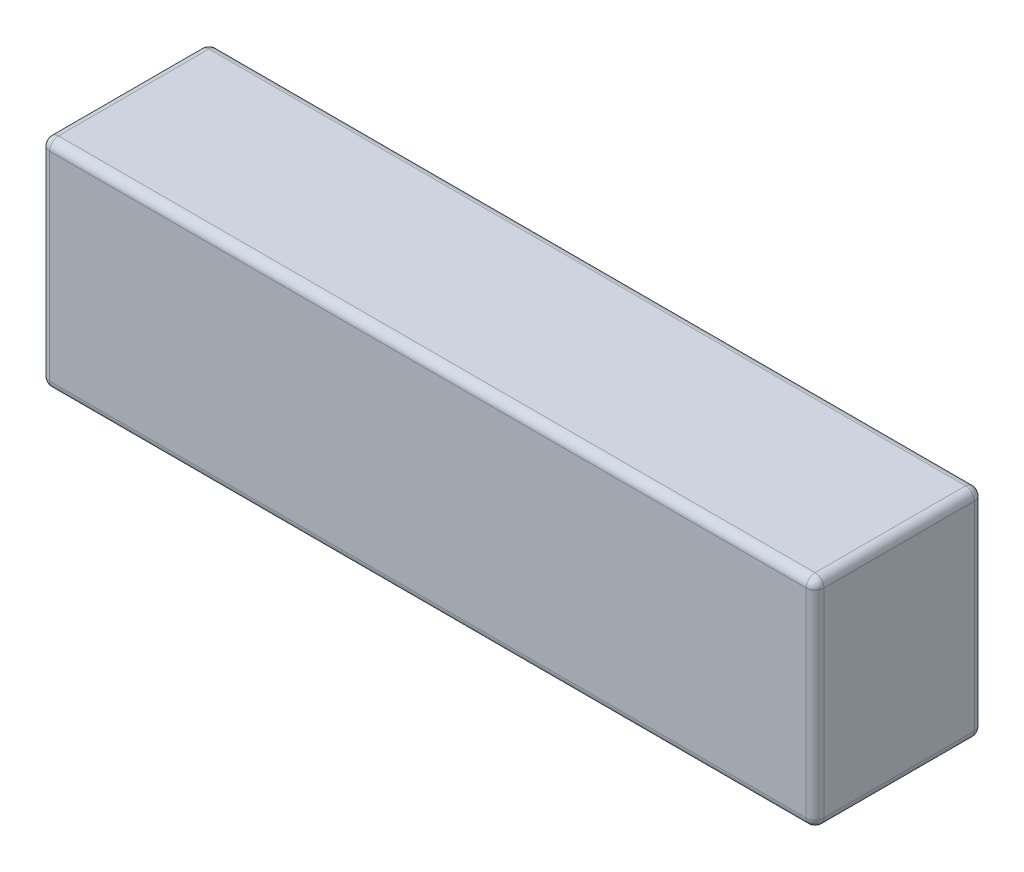
ISO-10303-21;
HEADER;
FILE_DESCRIPTION(('STEP AP214'),'2;1');
FILE_NAME('part.step','',(''),(''),'','','');
FILE_SCHEMA(('AUTOMOTIVE_DESIGN { 1 0 10303 214 1 1 1 1 }'));
ENDSEC;
DATA;
#1=APPLICATION_CONTEXT('core data for automotive mechanical design processes');
#2=APPLICATION_PROTOCOL_DEFINITION('international standard','automotive_design',2000,#1);
#3=PRODUCT_CONTEXT('',#1,'mechanical');
#4=PRODUCT('Part','Part','',(#3));
#5=PRODUCT_RELATED_PRODUCT_CATEGORY('part','',(#4));
#6=PRODUCT_DEFINITION_FORMATION('','',#4);
#7=PRODUCT_DEFINITION_CONTEXT('part definition',#1,'design');
#8=PRODUCT_DEFINITION('design','',#6,#7);
#9=PRODUCT_DEFINITION_SHAPE('','',#8);
#10=(LENGTH_UNIT() NAMED_UNIT(*) SI_UNIT(.MILLI.,.METRE.));
#11=(NAMED_UNIT(*) PLANE_ANGLE_UNIT() SI_UNIT($,.RADIAN.));
#12=(NAMED_UNIT(*) SI_UNIT($,.STERADIAN.) SOLID_ANGLE_UNIT());
#13=UNCERTAINTY_MEASURE_WITH_UNIT(LENGTH_MEASURE(1.E-05),#10,'distance_accuracy_value','');
#14=(GEOMETRIC_REPRESENTATION_CONTEXT(3) GLOBAL_UNCERTAINTY_ASSIGNED_CONTEXT((#13)) GLOBAL_UNIT_ASSIGNED_CONTEXT((#10,
#11,#12)) REPRESENTATION_CONTEXT('',''));
#15=CARTESIAN_POINT('',(0.,0.,0.));
#16=DIRECTION('',(0.,0.,1.));
#17=DIRECTION('',(1.,0.,0.));
#18=AXIS2_PLACEMENT_3D('',#15,#16,#17);
#19=CARTESIAN_POINT('',(0.,49.,0.));
#20=DIRECTION('',(1.,0.,0.));
#21=DIRECTION('',(0.,0.,-1.));
#22=AXIS2_PLACEMENT_3D('',#19,#20,#21);
#23=PLANE('',#22);
#24=DIRECTION('',(0.,0.,1.));
#25=VECTOR('',#24,1.);
#26=CARTESIAN_POINT('',(0.,2.,0.));
#27=LINE('',#26,#25);
#28=CARTESIAN_POINT('',(0.,2.,-36.));
#29=VERTEX_POINT('',#28);
#30=CARTESIAN_POINT('',(0.,2.,-2.));
#31=VERTEX_POINT('',#30);
#32=EDGE_CURVE('E197',#29,#31,#27,.T.);
#33=ORIENTED_EDGE('',*,*,#32,.T.);
#34=DIRECTION('',(0.,-1.,0.));
#35=VECTOR('',#34,1.);
#36=CARTESIAN_POINT('',(0.,49.,-2.));
#37=LINE('',#36,#35);
#38=CARTESIAN_POINT('',(0.,47.,-2.));
#39=VERTEX_POINT('',#38);
#40=EDGE_CURVE('E200',#31,#39,#37,.F.);
#41=ORIENTED_EDGE('',*,*,#40,.T.);
#42=DIRECTION('',(0.,0.,1.));
#43=VECTOR('',#42,1.);
#44=CARTESIAN_POINT('',(0.,47.,0.));
#45=LINE('',#44,#43);
#46=CARTESIAN_POINT('',(0.,47.,-36.));
#47=VERTEX_POINT('',#46);
#48=EDGE_CURVE('E195',#39,#47,#45,.F.);
#49=ORIENTED_EDGE('',*,*,#48,.T.);
#50=DIRECTION('',(0.,-1.,0.));
#51=VECTOR('',#50,1.);
#52=CARTESIAN_POINT('',(0.,49.,-36.));
#53=LINE('',#52,#51);
#54=EDGE_CURVE('E192',#47,#29,#53,.T.);
#55=ORIENTED_EDGE('',*,*,#54,.T.);
#56=EDGE_LOOP('',(#33,#41,#49,#55));
#57=FACE_BOUND('',#56,.T.);
#58=ADVANCED_FACE('F40',(#57),#23,.F.);
#59=CARTESIAN_POINT('',(0.,49.,0.));
#60=DIRECTION('',(0.,0.,-1.));
#61=DIRECTION('',(-1.,0.,0.));
#62=AXIS2_PLACEMENT_3D('',#59,#60,#61);
#63=PLANE('',#62);
#64=DIRECTION('',(0.,-1.,0.));
#65=VECTOR('',#64,1.);
#66=CARTESIAN_POINT('',(2.,49.,0.));
#67=LINE('',#66,#65);
#68=CARTESIAN_POINT('',(2.,47.,0.));
#69=VERTEX_POINT('',#68);
#70=CARTESIAN_POINT('',(2.,2.,0.));
#71=VERTEX_POINT('',#70);
#72=EDGE_CURVE('E154',#69,#71,#67,.T.);
#73=ORIENTED_EDGE('',*,*,#72,.T.);
#74=DIRECTION('',(1.,0.,0.));
#75=VECTOR('',#74,1.);
#76=CARTESIAN_POINT('',(175.,2.,0.));
#77=LINE('',#76,#75);
#78=CARTESIAN_POINT('',(173.,2.,0.));
#79=VERTEX_POINT('',#78);
#80=EDGE_CURVE('E149',#71,#79,#77,.T.);
#81=ORIENTED_EDGE('',*,*,#80,.T.);
#82=DIRECTION('',(0.,-1.,0.));
#83=VECTOR('',#82,1.);
#84=CARTESIAN_POINT('',(173.,49.,0.));
#85=LINE('',#84,#83);
#86=CARTESIAN_POINT('',(173.,47.,0.));
#87=VERTEX_POINT('',#86);
#88=EDGE_CURVE('E141',#79,#87,#85,.F.);
#89=ORIENTED_EDGE('',*,*,#88,.T.);
#90=DIRECTION('',(1.,0.,0.));
#91=VECTOR('',#90,1.);
#92=CARTESIAN_POINT('',(0.,47.,0.));
#93=LINE('',#92,#91);
#94=EDGE_CURVE('E146',#87,#69,#93,.F.);
#95=ORIENTED_EDGE('',*,*,#94,.T.);
#96=EDGE_LOOP('',(#73,#81,#89,#95));
#97=FACE_BOUND('',#96,.T.);
#98=ADVANCED_FACE('F144',(#97),#63,.F.);
#99=CARTESIAN_POINT('',(175.,49.,0.));
#100=DIRECTION('',(-1.,0.,0.));
#101=DIRECTION('',(0.,0.,1.));
#102=AXIS2_PLACEMENT_3D('',#99,#100,#101);
#103=PLANE('',#102);
#104=DIRECTION('',(0.,0.,-1.));
#105=VECTOR('',#104,1.);
#106=CARTESIAN_POINT('',(175.,47.,0.));
#107=LINE('',#106,#105);
#108=CARTESIAN_POINT('',(175.,47.,-36.));
#109=VERTEX_POINT('',#108);
#110=CARTESIAN_POINT('',(175.,47.,-2.));
#111=VERTEX_POINT('',#110);
#112=EDGE_CURVE('E206',#109,#111,#107,.F.);
#113=ORIENTED_EDGE('',*,*,#112,.T.);
#114=DIRECTION('',(0.,-1.,0.));
#115=VECTOR('',#114,1.);
#116=CARTESIAN_POINT('',(175.,49.,-2.));
#117=LINE('',#116,#115);
#118=CARTESIAN_POINT('',(175.,2.,-2.));
#119=VERTEX_POINT('',#118);
#120=EDGE_CURVE('E162',#111,#119,#117,.T.);
#121=ORIENTED_EDGE('',*,*,#120,.T.);
#122=DIRECTION('',(0.,0.,-1.));
#123=VECTOR('',#122,1.);
#124=CARTESIAN_POINT('',(175.,2.,-38.));
#125=LINE('',#124,#123);
#126=CARTESIAN_POINT('',(175.,2.,-36.));
#127=VERTEX_POINT('',#126);
#128=EDGE_CURVE('E209',#119,#127,#125,.T.);
#129=ORIENTED_EDGE('',*,*,#128,.T.);
#130=DIRECTION('',(0.,-1.,0.));
#131=VECTOR('',#130,1.);
#132=CARTESIAN_POINT('',(175.,49.,-36.));
#133=LINE('',#132,#131);
#134=EDGE_CURVE('E203',#127,#109,#133,.F.);
#135=ORIENTED_EDGE('',*,*,#134,.T.);
#136=EDGE_LOOP('',(#113,#121,#129,#135));
#137=FACE_BOUND('',#136,.T.);
#138=ADVANCED_FACE('F387',(#137),#103,.F.);
#139=CARTESIAN_POINT('',(0.,49.,-38.));
#140=DIRECTION('',(0.,0.,1.));
#141=DIRECTION('',(1.,0.,0.));
#142=AXIS2_PLACEMENT_3D('',#139,#140,#141);
#143=PLANE('',#142);
#144=DIRECTION('',(-1.,0.,0.));
#145=VECTOR('',#144,1.);
#146=CARTESIAN_POINT('',(0.,47.,-38.));
#147=LINE('',#146,#145);
#148=CARTESIAN_POINT('',(2.,47.,-38.));
#149=VERTEX_POINT('',#148);
#150=CARTESIAN_POINT('',(173.,47.,-38.));
#151=VERTEX_POINT('',#150);
#152=EDGE_CURVE('E50',#149,#151,#147,.F.);
#153=ORIENTED_EDGE('',*,*,#152,.T.);
#154=DIRECTION('',(0.,-1.,0.));
#155=VECTOR('',#154,1.);
#156=CARTESIAN_POINT('',(173.,49.,-38.));
#157=LINE('',#156,#155);
#158=CARTESIAN_POINT('',(173.,2.,-38.));
#159=VERTEX_POINT('',#158);
#160=EDGE_CURVE('E11',#151,#159,#157,.T.);
#161=ORIENTED_EDGE('',*,*,#160,.T.);
#162=DIRECTION('',(-1.,0.,0.));
#163=VECTOR('',#162,1.);
#164=CARTESIAN_POINT('',(0.,2.,-38.));
#165=LINE('',#164,#163);
#166=CARTESIAN_POINT('',(2.,2.,-38.));
#167=VERTEX_POINT('',#166);
#168=EDGE_CURVE('E238',#159,#167,#165,.T.);
#169=ORIENTED_EDGE('',*,*,#168,.T.);
#170=DIRECTION('',(0.,-1.,0.));
#171=VECTOR('',#170,1.);
#172=CARTESIAN_POINT('',(2.,49.,-38.));
#173=LINE('',#172,#171);
#174=EDGE_CURVE('E64',#167,#149,#173,.F.);
#175=ORIENTED_EDGE('',*,*,#174,.T.);
#176=EDGE_LOOP('',(#153,#161,#169,#175));
#177=FACE_BOUND('',#176,.T.);
#178=ADVANCED_FACE('F326',(#177),#143,.F.);
#179=CARTESIAN_POINT('',(0.,49.,-38.));
#180=DIRECTION('',(0.,-1.,0.));
#181=DIRECTION('',(0.,0.,-1.));
#182=AXIS2_PLACEMENT_3D('',#179,#180,#181);
#183=PLANE('',#182);
#184=DIRECTION('',(1.,0.,0.));
#185=VECTOR('',#184,1.);
#186=CARTESIAN_POINT('',(0.,49.,-2.));
#187=LINE('',#186,#185);
#188=CARTESIAN_POINT('',(2.,49.,-2.));
#189=VERTEX_POINT('',#188);
#190=CARTESIAN_POINT('',(173.,49.,-2.));
#191=VERTEX_POINT('',#190);
#192=EDGE_CURVE('E232',#189,#191,#187,.T.);
#193=ORIENTED_EDGE('',*,*,#192,.T.);
#194=DIRECTION('',(0.,0.,-1.));
#195=VECTOR('',#194,1.);
#196=CARTESIAN_POINT('',(173.,49.,-38.));
#197=LINE('',#196,#195);
#198=CARTESIAN_POINT('',(173.,49.,-36.));
#199=VERTEX_POINT('',#198);
#200=EDGE_CURVE('E234',#191,#199,#197,.T.);
#201=ORIENTED_EDGE('',*,*,#200,.T.);
#202=DIRECTION('',(-1.,0.,0.));
#203=VECTOR('',#202,1.);
#204=CARTESIAN_POINT('',(0.,49.,-36.));
#205=LINE('',#204,#203);
#206=CARTESIAN_POINT('',(2.,49.,-36.));
#207=VERTEX_POINT('',#206);
#208=EDGE_CURVE('E227',#199,#207,#205,.T.);
#209=ORIENTED_EDGE('',*,*,#208,.T.);
#210=DIRECTION('',(0.,0.,1.));
#211=VECTOR('',#210,1.);
#212=CARTESIAN_POINT('',(2.,49.,-38.));
#213=LINE('',#212,#211);
#214=EDGE_CURVE('E230',#207,#189,#213,.T.);
#215=ORIENTED_EDGE('',*,*,#214,.T.);
#216=EDGE_LOOP('',(#193,#201,#209,#215));
#217=FACE_BOUND('',#216,.T.);
#218=ADVANCED_FACE('F350',(#217),#183,.F.);
#219=CARTESIAN_POINT('',(0.,0.,-38.));
#220=DIRECTION('',(0.,-1.,0.));
#221=DIRECTION('',(0.,0.,-1.));
#222=AXIS2_PLACEMENT_3D('',#219,#220,#221);
#223=PLANE('',#222);
#224=DIRECTION('',(0.,0.,-1.));
#225=VECTOR('',#224,1.);
#226=CARTESIAN_POINT('',(173.,0.,0.));
#227=LINE('',#226,#225);
#228=CARTESIAN_POINT('',(173.,0.,-36.));
#229=VERTEX_POINT('',#228);
#230=CARTESIAN_POINT('',(173.,0.,-2.));
#231=VERTEX_POINT('',#230);
#232=EDGE_CURVE('E220',#229,#231,#227,.F.);
#233=ORIENTED_EDGE('',*,*,#232,.T.);
#234=DIRECTION('',(1.,0.,0.));
#235=VECTOR('',#234,1.);
#236=CARTESIAN_POINT('',(0.,0.,-2.));
#237=LINE('',#236,#235);
#238=CARTESIAN_POINT('',(2.,0.,-2.));
#239=VERTEX_POINT('',#238);
#240=EDGE_CURVE('E223',#231,#239,#237,.F.);
#241=ORIENTED_EDGE('',*,*,#240,.T.);
#242=DIRECTION('',(0.,0.,1.));
#243=VECTOR('',#242,1.);
#244=CARTESIAN_POINT('',(2.,0.,-38.));
#245=LINE('',#244,#243);
#246=CARTESIAN_POINT('',(2.,0.,-36.));
#247=VERTEX_POINT('',#246);
#248=EDGE_CURVE('E217',#239,#247,#245,.F.);
#249=ORIENTED_EDGE('',*,*,#248,.T.);
#250=DIRECTION('',(-1.,0.,0.));
#251=VECTOR('',#250,1.);
#252=CARTESIAN_POINT('',(175.,0.,-36.));
#253=LINE('',#252,#251);
#254=EDGE_CURVE('E214',#247,#229,#253,.F.);
#255=ORIENTED_EDGE('',*,*,#254,.T.);
#256=EDGE_LOOP('',(#233,#241,#249,#255));
#257=FACE_BOUND('',#256,.T.);
#258=ADVANCED_FACE('F319',(#257),#223,.T.);
#259=CARTESIAN_POINT('',(173.,49.,-36.));
#260=DIRECTION('',(0.,-1.,0.));
#261=DIRECTION('',(0.,0.,-1.));
#262=AXIS2_PLACEMENT_3D('',#259,#260,#261);
#263=CYLINDRICAL_SURFACE('',#262,2.);
#264=CARTESIAN_POINT('',(173.,47.,-36.));
#265=DIRECTION('',(0.,1.,0.));
#266=DIRECTION('',(0.,0.,1.));
#267=AXIS2_PLACEMENT_3D('',#264,#265,#266);
#268=CIRCLE('',#267,2.);
#269=EDGE_CURVE('E44',#109,#151,#268,.T.);
#270=ORIENTED_EDGE('',*,*,#269,.F.);
#271=ORIENTED_EDGE('',*,*,#134,.F.);
#272=CARTESIAN_POINT('',(173.,2.,-36.));
#273=DIRECTION('',(0.,-1.,0.));
#274=DIRECTION('',(0.,0.,-1.));
#275=AXIS2_PLACEMENT_3D('',#272,#273,#274);
#276=CIRCLE('',#275,2.);
#277=EDGE_CURVE('E187',#159,#127,#276,.T.);
#278=ORIENTED_EDGE('',*,*,#277,.F.);
#279=ORIENTED_EDGE('',*,*,#160,.F.);
#280=EDGE_LOOP('',(#270,#271,#278,#279));
#281=FACE_BOUND('',#280,.T.);
#282=ADVANCED_FACE('F42',(#281),#263,.T.);
#283=CARTESIAN_POINT('',(173.,47.,-36.));
#284=DIRECTION('',(0.,0.,1.));
#285=DIRECTION('',(1.,0.,0.));
#286=AXIS2_PLACEMENT_3D('',#283,#284,#285);
#287=SPHERICAL_SURFACE('',#286,2.);
#288=CARTESIAN_POINT('',(173.,47.,-36.));
#289=DIRECTION('',(0.,0.,-1.));
#290=DIRECTION('',(-1.,0.,0.));
#291=AXIS2_PLACEMENT_3D('',#288,#289,#290);
#292=CIRCLE('',#291,2.);
#293=EDGE_CURVE('E297',#109,#199,#292,.F.);
#294=ORIENTED_EDGE('',*,*,#293,.F.);
#295=ORIENTED_EDGE('',*,*,#269,.T.);
#296=CARTESIAN_POINT('',(173.,47.,-36.));
#297=DIRECTION('',(1.,0.,0.));
#298=DIRECTION('',(0.,0.,-1.));
#299=AXIS2_PLACEMENT_3D('',#296,#297,#298);
#300=CIRCLE('',#299,2.);
#301=EDGE_CURVE('E300',#199,#151,#300,.F.);
#302=ORIENTED_EDGE('',*,*,#301,.F.);
#303=EDGE_LOOP('',(#294,#295,#302));
#304=FACE_BOUND('',#303,.T.);
#305=ADVANCED_FACE('F343',(#304),#287,.T.);
#306=CARTESIAN_POINT('',(173.,2.,-36.));
#307=DIRECTION('',(0.,0.,1.));
#308=DIRECTION('',(1.,0.,0.));
#309=AXIS2_PLACEMENT_3D('',#306,#307,#308);
#310=SPHERICAL_SURFACE('',#309,2.);
#311=CARTESIAN_POINT('',(173.,2.,-36.));
#312=DIRECTION('',(1.,0.,0.));
#313=DIRECTION('',(0.,0.,-1.));
#314=AXIS2_PLACEMENT_3D('',#311,#312,#313);
#315=CIRCLE('',#314,2.);
#316=EDGE_CURVE('E289',#159,#229,#315,.F.);
#317=ORIENTED_EDGE('',*,*,#316,.F.);
#318=ORIENTED_EDGE('',*,*,#277,.T.);
#319=CARTESIAN_POINT('',(173.,2.,-36.));
#320=DIRECTION('',(0.,0.,-1.));
#321=DIRECTION('',(-1.,0.,0.));
#322=AXIS2_PLACEMENT_3D('',#319,#320,#321);
#323=CIRCLE('',#322,2.);
#324=EDGE_CURVE('E293',#229,#127,#323,.F.);
#325=ORIENTED_EDGE('',*,*,#324,.F.);
#326=EDGE_LOOP('',(#317,#318,#325));
#327=FACE_BOUND('',#326,.T.);
#328=ADVANCED_FACE('F309',(#327),#310,.T.);
#329=CARTESIAN_POINT('',(0.,47.,-36.));
#330=DIRECTION('',(-1.,0.,0.));
#331=DIRECTION('',(0.,0.,1.));
#332=AXIS2_PLACEMENT_3D('',#329,#330,#331);
#333=CYLINDRICAL_SURFACE('',#332,2.);
#334=ORIENTED_EDGE('',*,*,#301,.T.);
#335=ORIENTED_EDGE('',*,*,#152,.F.);
#336=CARTESIAN_POINT('',(2.,47.,-36.));
#337=DIRECTION('',(-1.,0.,0.));
#338=DIRECTION('',(0.,0.,1.));
#339=AXIS2_PLACEMENT_3D('',#336,#337,#338);
#340=CIRCLE('',#339,2.);
#341=EDGE_CURVE('E283',#207,#149,#340,.T.);
#342=ORIENTED_EDGE('',*,*,#341,.F.);
#343=ORIENTED_EDGE('',*,*,#208,.F.);
#344=EDGE_LOOP('',(#334,#335,#342,#343));
#345=FACE_BOUND('',#344,.T.);
#346=ADVANCED_FACE('F339',(#345),#333,.T.);
#347=CARTESIAN_POINT('',(173.,47.,-38.));
#348=DIRECTION('',(0.,0.,-1.));
#349=DIRECTION('',(-1.,0.,0.));
#350=AXIS2_PLACEMENT_3D('',#347,#348,#349);
#351=CYLINDRICAL_SURFACE('',#350,2.);
#352=ORIENTED_EDGE('',*,*,#293,.T.);
#353=ORIENTED_EDGE('',*,*,#200,.F.);
#354=CARTESIAN_POINT('',(173.,47.,-2.));
#355=DIRECTION('',(0.,0.,1.));
#356=DIRECTION('',(0.,-1.,0.));
#357=AXIS2_PLACEMENT_3D('',#354,#355,#356);
#358=CIRCLE('',#357,2.);
#359=EDGE_CURVE('E166',#111,#191,#358,.T.);
#360=ORIENTED_EDGE('',*,*,#359,.F.);
#361=ORIENTED_EDGE('',*,*,#112,.F.);
#362=EDGE_LOOP('',(#352,#353,#360,#361));
#363=FACE_BOUND('',#362,.T.);
#364=ADVANCED_FACE('F348',(#363),#351,.T.);
#365=CARTESIAN_POINT('',(173.,49.,-2.));
#366=DIRECTION('',(0.,-1.,0.));
#367=DIRECTION('',(0.,0.,-1.));
#368=AXIS2_PLACEMENT_3D('',#365,#366,#367);
#369=CYLINDRICAL_SURFACE('',#368,2.);
#370=CARTESIAN_POINT('',(173.,2.,-2.));
#371=DIRECTION('',(0.,-1.,0.));
#372=DIRECTION('',(0.,0.,-1.));
#373=AXIS2_PLACEMENT_3D('',#370,#371,#372);
#374=CIRCLE('',#373,2.);
#375=EDGE_CURVE('E167',#119,#79,#374,.T.);
#376=ORIENTED_EDGE('',*,*,#375,.F.);
#377=ORIENTED_EDGE('',*,*,#120,.F.);
#378=CARTESIAN_POINT('',(173.,47.,-2.));
#379=DIRECTION('',(0.,1.,0.));
#380=DIRECTION('',(0.,0.,1.));
#381=AXIS2_PLACEMENT_3D('',#378,#379,#380);
#382=CIRCLE('',#381,2.);
#383=EDGE_CURVE('E158',#87,#111,#382,.T.);
#384=ORIENTED_EDGE('',*,*,#383,.F.);
#385=ORIENTED_EDGE('',*,*,#88,.F.);
#386=EDGE_LOOP('',(#376,#377,#384,#385));
#387=FACE_BOUND('',#386,.T.);
#388=ADVANCED_FACE('F160',(#387),#369,.T.);
#389=CARTESIAN_POINT('',(173.,2.,0.));
#390=DIRECTION('',(0.,0.,1.));
#391=DIRECTION('',(1.,0.,0.));
#392=AXIS2_PLACEMENT_3D('',#389,#390,#391);
#393=CYLINDRICAL_SURFACE('',#392,2.);
#394=ORIENTED_EDGE('',*,*,#324,.T.);
#395=ORIENTED_EDGE('',*,*,#128,.F.);
#396=CARTESIAN_POINT('',(173.,2.,-2.));
#397=DIRECTION('',(0.,0.,1.));
#398=DIRECTION('',(1.,0.,0.));
#399=AXIS2_PLACEMENT_3D('',#396,#397,#398);
#400=CIRCLE('',#399,2.);
#401=EDGE_CURVE('E277',#231,#119,#400,.T.);
#402=ORIENTED_EDGE('',*,*,#401,.F.);
#403=ORIENTED_EDGE('',*,*,#232,.F.);
#404=EDGE_LOOP('',(#394,#395,#402,#403));
#405=FACE_BOUND('',#404,.T.);
#406=ADVANCED_FACE('F315',(#405),#393,.T.);
#407=CARTESIAN_POINT('',(0.,2.,-36.));
#408=DIRECTION('',(1.,0.,0.));
#409=DIRECTION('',(0.,0.,-1.));
#410=AXIS2_PLACEMENT_3D('',#407,#408,#409);
#411=CYLINDRICAL_SURFACE('',#410,2.);
#412=ORIENTED_EDGE('',*,*,#316,.T.);
#413=ORIENTED_EDGE('',*,*,#254,.F.);
#414=CARTESIAN_POINT('',(2.,2.,-36.));
#415=DIRECTION('',(-1.,0.,0.));
#416=DIRECTION('',(0.,0.,1.));
#417=AXIS2_PLACEMENT_3D('',#414,#415,#416);
#418=CIRCLE('',#417,2.);
#419=EDGE_CURVE('E273',#167,#247,#418,.T.);
#420=ORIENTED_EDGE('',*,*,#419,.F.);
#421=ORIENTED_EDGE('',*,*,#168,.F.);
#422=EDGE_LOOP('',(#412,#413,#420,#421));
#423=FACE_BOUND('',#422,.T.);
#424=ADVANCED_FACE('F325',(#423),#411,.T.);
#425=CARTESIAN_POINT('',(2.,49.,-36.));
#426=DIRECTION('',(0.,-1.,0.));
#427=DIRECTION('',(0.,0.,-1.));
#428=AXIS2_PLACEMENT_3D('',#425,#426,#427);
#429=CYLINDRICAL_SURFACE('',#428,2.);
#430=CARTESIAN_POINT('',(2.,47.,-36.));
#431=DIRECTION('',(0.,1.,0.));
#432=DIRECTION('',(0.,0.,1.));
#433=AXIS2_PLACEMENT_3D('',#430,#431,#432);
#434=CIRCLE('',#433,2.);
#435=EDGE_CURVE('E286',#149,#47,#434,.T.);
#436=ORIENTED_EDGE('',*,*,#435,.F.);
#437=ORIENTED_EDGE('',*,*,#174,.F.);
#438=CARTESIAN_POINT('',(2.,2.,-36.));
#439=DIRECTION('',(0.,-1.,0.));
#440=DIRECTION('',(0.,0.,-1.));
#441=AXIS2_PLACEMENT_3D('',#438,#439,#440);
#442=CIRCLE('',#441,2.);
#443=EDGE_CURVE('E269',#29,#167,#442,.T.);
#444=ORIENTED_EDGE('',*,*,#443,.F.);
#445=ORIENTED_EDGE('',*,*,#54,.F.);
#446=EDGE_LOOP('',(#436,#437,#444,#445));
#447=FACE_BOUND('',#446,.T.);
#448=ADVANCED_FACE('F330',(#447),#429,.T.);
#449=CARTESIAN_POINT('',(2.,47.,-36.));
#450=DIRECTION('',(0.,0.,1.));
#451=DIRECTION('',(1.,0.,0.));
#452=AXIS2_PLACEMENT_3D('',#449,#450,#451);
#453=SPHERICAL_SURFACE('',#452,2.);
#454=ORIENTED_EDGE('',*,*,#341,.T.);
#455=ORIENTED_EDGE('',*,*,#435,.T.);
#456=CARTESIAN_POINT('',(2.,47.,-36.));
#457=DIRECTION('',(0.,0.,-1.));
#458=DIRECTION('',(-1.,0.,0.));
#459=AXIS2_PLACEMENT_3D('',#456,#457,#458);
#460=CIRCLE('',#459,2.);
#461=EDGE_CURVE('E174',#207,#47,#460,.F.);
#462=ORIENTED_EDGE('',*,*,#461,.F.);
#463=EDGE_LOOP('',(#454,#455,#462));
#464=FACE_BOUND('',#463,.T.);
#465=ADVANCED_FACE('F336',(#464),#453,.T.);
#466=CARTESIAN_POINT('',(173.,47.,-2.));
#467=DIRECTION('',(0.,0.,1.));
#468=DIRECTION('',(1.,0.,0.));
#469=AXIS2_PLACEMENT_3D('',#466,#467,#468);
#470=SPHERICAL_SURFACE('',#469,2.);
#471=ORIENTED_EDGE('',*,*,#383,.T.);
#472=ORIENTED_EDGE('',*,*,#359,.T.);
#473=CARTESIAN_POINT('',(173.,47.,-2.));
#474=DIRECTION('',(1.,0.,0.));
#475=DIRECTION('',(0.,0.,-1.));
#476=AXIS2_PLACEMENT_3D('',#473,#474,#475);
#477=CIRCLE('',#476,2.);
#478=EDGE_CURVE('E170',#87,#191,#477,.F.);
#479=ORIENTED_EDGE('',*,*,#478,.F.);
#480=EDGE_LOOP('',(#471,#472,#479));
#481=FACE_BOUND('',#480,.T.);
#482=ADVANCED_FACE('F171',(#481),#470,.T.);
#483=CARTESIAN_POINT('',(173.,2.,-2.));
#484=DIRECTION('',(0.,0.,1.));
#485=DIRECTION('',(1.,0.,0.));
#486=AXIS2_PLACEMENT_3D('',#483,#484,#485);
#487=SPHERICAL_SURFACE('',#486,2.);
#488=ORIENTED_EDGE('',*,*,#401,.T.);
#489=ORIENTED_EDGE('',*,*,#375,.T.);
#490=CARTESIAN_POINT('',(173.,2.,-2.));
#491=DIRECTION('',(1.,0.,0.));
#492=DIRECTION('',(0.,0.,-1.));
#493=AXIS2_PLACEMENT_3D('',#490,#491,#492);
#494=CIRCLE('',#493,2.);
#495=EDGE_CURVE('E175',#231,#79,#494,.F.);
#496=ORIENTED_EDGE('',*,*,#495,.F.);
#497=EDGE_LOOP('',(#488,#489,#496));
#498=FACE_BOUND('',#497,.T.);
#499=ADVANCED_FACE('F369',(#498),#487,.T.);
#500=CARTESIAN_POINT('',(2.,2.,-36.));
#501=DIRECTION('',(0.,0.,1.));
#502=DIRECTION('',(1.,0.,0.));
#503=AXIS2_PLACEMENT_3D('',#500,#501,#502);
#504=SPHERICAL_SURFACE('',#503,2.);
#505=ORIENTED_EDGE('',*,*,#443,.T.);
#506=ORIENTED_EDGE('',*,*,#419,.T.);
#507=CARTESIAN_POINT('',(2.,2.,-36.));
#508=DIRECTION('',(0.,0.,-1.));
#509=DIRECTION('',(-1.,0.,0.));
#510=AXIS2_PLACEMENT_3D('',#507,#508,#509);
#511=CIRCLE('',#510,2.);
#512=EDGE_CURVE('E260',#29,#247,#511,.F.);
#513=ORIENTED_EDGE('',*,*,#512,.F.);
#514=EDGE_LOOP('',(#505,#506,#513));
#515=FACE_BOUND('',#514,.T.);
#516=ADVANCED_FACE('F371',(#515),#504,.T.);
#517=CARTESIAN_POINT('',(2.,47.,-38.));
#518=DIRECTION('',(0.,0.,1.));
#519=DIRECTION('',(1.,0.,0.));
#520=AXIS2_PLACEMENT_3D('',#517,#518,#519);
#521=CYLINDRICAL_SURFACE('',#520,2.);
#522=ORIENTED_EDGE('',*,*,#461,.T.);
#523=ORIENTED_EDGE('',*,*,#48,.F.);
#524=CARTESIAN_POINT('',(2.,47.,-2.));
#525=DIRECTION('',(0.,0.,1.));
#526=DIRECTION('',(1.,0.,0.));
#527=AXIS2_PLACEMENT_3D('',#524,#525,#526);
#528=CIRCLE('',#527,2.);
#529=EDGE_CURVE('E257',#189,#39,#528,.T.);
#530=ORIENTED_EDGE('',*,*,#529,.F.);
#531=ORIENTED_EDGE('',*,*,#214,.F.);
#532=EDGE_LOOP('',(#522,#523,#530,#531));
#533=FACE_BOUND('',#532,.T.);
#534=ADVANCED_FACE('F354',(#533),#521,.T.);
#535=CARTESIAN_POINT('',(0.,47.,-2.));
#536=DIRECTION('',(1.,0.,0.));
#537=DIRECTION('',(0.,0.,-1.));
#538=AXIS2_PLACEMENT_3D('',#535,#536,#537);
#539=CYLINDRICAL_SURFACE('',#538,2.);
#540=ORIENTED_EDGE('',*,*,#478,.T.);
#541=ORIENTED_EDGE('',*,*,#192,.F.);
#542=CARTESIAN_POINT('',(2.,47.,-2.));
#543=DIRECTION('',(-1.,0.,0.));
#544=DIRECTION('',(0.,0.,1.));
#545=AXIS2_PLACEMENT_3D('',#542,#543,#544);
#546=CIRCLE('',#545,2.);
#547=EDGE_CURVE('E179',#69,#189,#546,.T.);
#548=ORIENTED_EDGE('',*,*,#547,.F.);
#549=ORIENTED_EDGE('',*,*,#94,.F.);
#550=EDGE_LOOP('',(#540,#541,#548,#549));
#551=FACE_BOUND('',#550,.T.);
#552=ADVANCED_FACE('F177',(#551),#539,.T.);
#553=CARTESIAN_POINT('',(0.,2.,-2.));
#554=DIRECTION('',(-1.,0.,0.));
#555=DIRECTION('',(0.,0.,1.));
#556=AXIS2_PLACEMENT_3D('',#553,#554,#555);
#557=CYLINDRICAL_SURFACE('',#556,2.);
#558=ORIENTED_EDGE('',*,*,#495,.T.);
#559=ORIENTED_EDGE('',*,*,#80,.F.);
#560=CARTESIAN_POINT('',(2.,2.,-2.));
#561=DIRECTION('',(-1.,0.,0.));
#562=DIRECTION('',(0.,0.,1.));
#563=AXIS2_PLACEMENT_3D('',#560,#561,#562);
#564=CIRCLE('',#563,2.);
#565=EDGE_CURVE('E252',#239,#71,#564,.T.);
#566=ORIENTED_EDGE('',*,*,#565,.F.);
#567=ORIENTED_EDGE('',*,*,#240,.F.);
#568=EDGE_LOOP('',(#558,#559,#566,#567));
#569=FACE_BOUND('',#568,.T.);
#570=ADVANCED_FACE('F367',(#569),#557,.T.);
#571=CARTESIAN_POINT('',(2.,2.,0.));
#572=DIRECTION('',(0.,0.,-1.));
#573=DIRECTION('',(-1.,0.,0.));
#574=AXIS2_PLACEMENT_3D('',#571,#572,#573);
#575=CYLINDRICAL_SURFACE('',#574,2.);
#576=ORIENTED_EDGE('',*,*,#512,.T.);
#577=ORIENTED_EDGE('',*,*,#248,.F.);
#578=CARTESIAN_POINT('',(2.,2.,-2.));
#579=DIRECTION('',(0.,0.,1.));
#580=DIRECTION('',(1.,0.,0.));
#581=AXIS2_PLACEMENT_3D('',#578,#579,#580);
#582=CIRCLE('',#581,2.);
#583=EDGE_CURVE('E249',#31,#239,#582,.T.);
#584=ORIENTED_EDGE('',*,*,#583,.F.);
#585=ORIENTED_EDGE('',*,*,#32,.F.);
#586=EDGE_LOOP('',(#576,#577,#584,#585));
#587=FACE_BOUND('',#586,.T.);
#588=ADVANCED_FACE('F397',(#587),#575,.T.);
#589=CARTESIAN_POINT('',(2.,47.,-2.));
#590=DIRECTION('',(0.,0.,1.));
#591=DIRECTION('',(1.,0.,0.));
#592=AXIS2_PLACEMENT_3D('',#589,#590,#591);
#593=SPHERICAL_SURFACE('',#592,2.);
#594=ORIENTED_EDGE('',*,*,#547,.T.);
#595=ORIENTED_EDGE('',*,*,#529,.T.);
#596=CARTESIAN_POINT('',(2.,47.,-2.));
#597=DIRECTION('',(0.,1.,0.));
#598=DIRECTION('',(0.,0.,1.));
#599=AXIS2_PLACEMENT_3D('',#596,#597,#598);
#600=CIRCLE('',#599,2.);
#601=EDGE_CURVE('E247',#69,#39,#600,.F.);
#602=ORIENTED_EDGE('',*,*,#601,.F.);
#603=EDGE_LOOP('',(#594,#595,#602));
#604=FACE_BOUND('',#603,.T.);
#605=ADVANCED_FACE('F356',(#604),#593,.T.);
#606=CARTESIAN_POINT('',(2.,2.,-2.));
#607=DIRECTION('',(0.,0.,1.));
#608=DIRECTION('',(1.,0.,0.));
#609=AXIS2_PLACEMENT_3D('',#606,#607,#608);
#610=SPHERICAL_SURFACE('',#609,2.);
#611=ORIENTED_EDGE('',*,*,#583,.T.);
#612=ORIENTED_EDGE('',*,*,#565,.T.);
#613=CARTESIAN_POINT('',(2.,2.,-2.));
#614=DIRECTION('',(0.,-1.,0.));
#615=DIRECTION('',(0.,0.,-1.));
#616=AXIS2_PLACEMENT_3D('',#613,#614,#615);
#617=CIRCLE('',#616,2.);
#618=EDGE_CURVE('E245',#31,#71,#617,.F.);
#619=ORIENTED_EDGE('',*,*,#618,.F.);
#620=EDGE_LOOP('',(#611,#612,#619));
#621=FACE_BOUND('',#620,.T.);
#622=ADVANCED_FACE('F364',(#621),#610,.T.);
#623=CARTESIAN_POINT('',(2.,49.,-2.));
#624=DIRECTION('',(0.,-1.,0.));
#625=DIRECTION('',(0.,0.,-1.));
#626=AXIS2_PLACEMENT_3D('',#623,#624,#625);
#627=CYLINDRICAL_SURFACE('',#626,2.);
#628=ORIENTED_EDGE('',*,*,#601,.T.);
#629=ORIENTED_EDGE('',*,*,#40,.F.);
#630=ORIENTED_EDGE('',*,*,#618,.T.);
#631=ORIENTED_EDGE('',*,*,#72,.F.);
#632=EDGE_LOOP('',(#628,#629,#630,#631));
#633=FACE_BOUND('',#632,.T.);
#634=ADVANCED_FACE('F360',(#633),#627,.T.);
#635=CLOSED_SHELL('',(#58,#98,#138,#178,#218,#258,#282,#305,#328,#346,#364,#388,#406,#424,#448,
#465,#482,#499,#516,#534,#552,#570,#588,#605,#622,#634));
#636=MANIFOLD_SOLID_BREP('B2',#635);
#637=ADVANCED_BREP_SHAPE_REPRESENTATION('',(#18,#636),#14);
#638=SHAPE_DEFINITION_REPRESENTATION(#9,#637);
ENDSEC;
END-ISO-10303-21;
